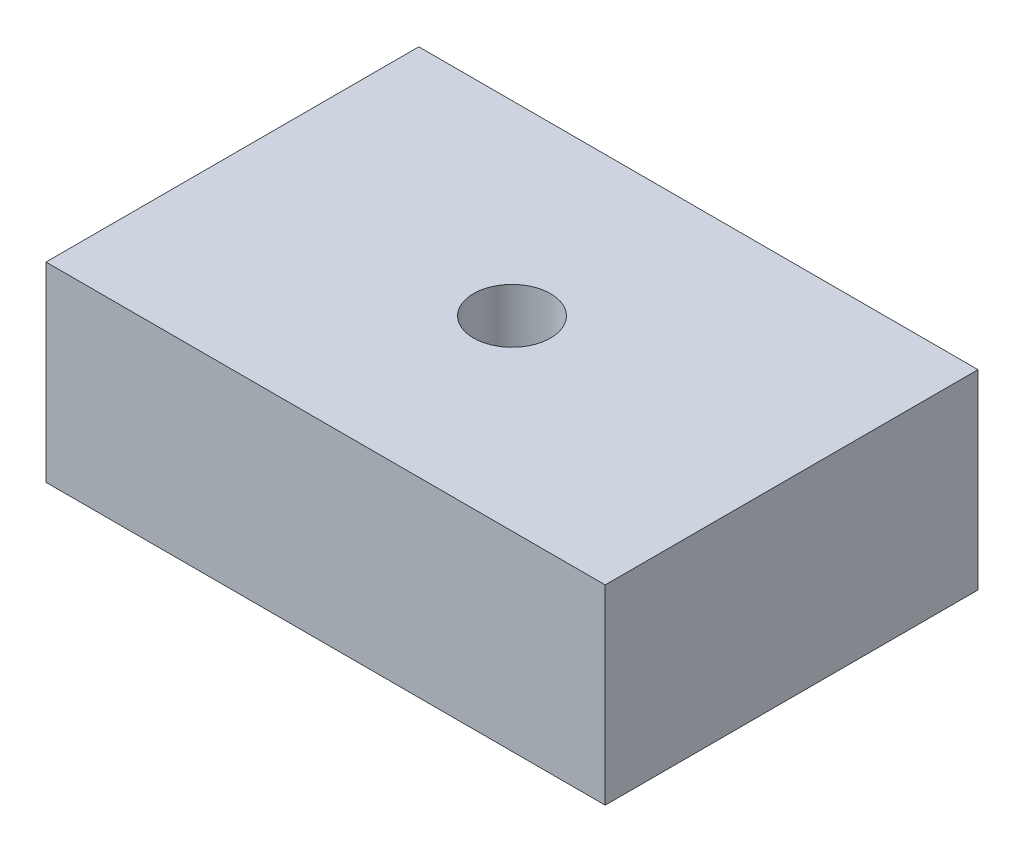
ISO-10303-21;
HEADER;
FILE_DESCRIPTION(('STEP AP214'),'2;1');
FILE_NAME('part.step','',(''),(''),'','','');
FILE_SCHEMA(('AUTOMOTIVE_DESIGN { 1 0 10303 214 1 1 1 1 }'));
ENDSEC;
DATA;
#1=APPLICATION_CONTEXT('core data for automotive mechanical design processes');
#2=APPLICATION_PROTOCOL_DEFINITION('international standard','automotive_design',2000,#1);
#3=PRODUCT_CONTEXT('',#1,'mechanical');
#4=PRODUCT('Part','Part','',(#3));
#5=PRODUCT_RELATED_PRODUCT_CATEGORY('part','',(#4));
#6=PRODUCT_DEFINITION_FORMATION('','',#4);
#7=PRODUCT_DEFINITION_CONTEXT('part definition',#1,'design');
#8=PRODUCT_DEFINITION('design','',#6,#7);
#9=PRODUCT_DEFINITION_SHAPE('','',#8);
#10=(LENGTH_UNIT() NAMED_UNIT(*) SI_UNIT(.MILLI.,.METRE.));
#11=(NAMED_UNIT(*) PLANE_ANGLE_UNIT() SI_UNIT($,.RADIAN.));
#12=(NAMED_UNIT(*) SI_UNIT($,.STERADIAN.) SOLID_ANGLE_UNIT());
#13=UNCERTAINTY_MEASURE_WITH_UNIT(LENGTH_MEASURE(1.E-05),#10,'distance_accuracy_value','');
#14=(GEOMETRIC_REPRESENTATION_CONTEXT(3) GLOBAL_UNCERTAINTY_ASSIGNED_CONTEXT((#13)) GLOBAL_UNIT_ASSIGNED_CONTEXT((#10,
#11,#12)) REPRESENTATION_CONTEXT('',''));
#15=CARTESIAN_POINT('',(0.,0.,0.));
#16=DIRECTION('',(0.,0.,1.));
#17=DIRECTION('',(1.,0.,0.));
#18=AXIS2_PLACEMENT_3D('',#15,#16,#17);
#19=CARTESIAN_POINT('',(38.1,26.,25.4));
#20=DIRECTION('',(0.,1.,0.));
#21=DIRECTION('',(0.,0.,1.));
#22=AXIS2_PLACEMENT_3D('',#19,#20,#21);
#23=PLANE('',#22);
#24=DIRECTION('',(0.,0.,-1.));
#25=VECTOR('',#24,1.);
#26=CARTESIAN_POINT('',(38.1,26.,-25.4));
#27=LINE('',#26,#25);
#28=CARTESIAN_POINT('',(38.1,26.,25.4));
#29=VERTEX_POINT('',#28);
#30=CARTESIAN_POINT('',(38.1,26.,-25.4));
#31=VERTEX_POINT('',#30);
#32=EDGE_CURVE('E85',#29,#31,#27,.T.);
#33=ORIENTED_EDGE('',*,*,#32,.T.);
#34=DIRECTION('',(-1.,0.,0.));
#35=VECTOR('',#34,1.);
#36=CARTESIAN_POINT('',(-38.1,26.,-25.4));
#37=LINE('',#36,#35);
#38=CARTESIAN_POINT('',(-38.1,26.,-25.4));
#39=VERTEX_POINT('',#38);
#40=EDGE_CURVE('E80',#31,#39,#37,.T.);
#41=ORIENTED_EDGE('',*,*,#40,.T.);
#42=DIRECTION('',(0.,0.,1.));
#43=VECTOR('',#42,1.);
#44=CARTESIAN_POINT('',(-38.1,26.,-25.4));
#45=LINE('',#44,#43);
#46=CARTESIAN_POINT('',(-38.1,26.,25.4));
#47=VERTEX_POINT('',#46);
#48=EDGE_CURVE('E83',#39,#47,#45,.T.);
#49=ORIENTED_EDGE('',*,*,#48,.T.);
#50=DIRECTION('',(1.,0.,0.));
#51=VECTOR('',#50,1.);
#52=CARTESIAN_POINT('',(-38.1,26.,25.4));
#53=LINE('',#52,#51);
#54=EDGE_CURVE('E50',#47,#29,#53,.T.);
#55=ORIENTED_EDGE('',*,*,#54,.T.);
#56=EDGE_LOOP('',(#33,#41,#49,#55));
#57=FACE_BOUND('',#56,.T.);
#58=CARTESIAN_POINT('',(0.,26.,0.));
#59=DIRECTION('',(0.,1.,0.));
#60=DIRECTION('',(0.,0.,1.));
#61=AXIS2_PLACEMENT_3D('',#58,#59,#60);
#62=CIRCLE('',#61,5.25);
#63=CARTESIAN_POINT('',(0.,26.,5.25));
#64=VERTEX_POINT('',#63);
#65=EDGE_CURVE('E100',#64,#64,#62,.T.);
#66=ORIENTED_EDGE('',*,*,#65,.F.);
#67=EDGE_LOOP('',(#66));
#68=FACE_BOUND('',#67,.T.);
#69=ADVANCED_FACE('F33',(#57,#68),#23,.T.);
#70=CARTESIAN_POINT('',(38.1,0.,25.4));
#71=DIRECTION('',(0.,1.,0.));
#72=DIRECTION('',(0.,0.,1.));
#73=AXIS2_PLACEMENT_3D('',#70,#71,#72);
#74=PLANE('',#73);
#75=DIRECTION('',(0.,0.,-1.));
#76=VECTOR('',#75,1.);
#77=CARTESIAN_POINT('',(38.1,0.,-25.4));
#78=LINE('',#77,#76);
#79=CARTESIAN_POINT('',(38.1,0.,25.4));
#80=VERTEX_POINT('',#79);
#81=CARTESIAN_POINT('',(38.1,0.,-25.4));
#82=VERTEX_POINT('',#81);
#83=EDGE_CURVE('E97',#80,#82,#78,.T.);
#84=ORIENTED_EDGE('',*,*,#83,.F.);
#85=DIRECTION('',(1.,0.,0.));
#86=VECTOR('',#85,1.);
#87=CARTESIAN_POINT('',(-38.1,0.,25.4));
#88=LINE('',#87,#86);
#89=CARTESIAN_POINT('',(-38.1,0.,25.4));
#90=VERTEX_POINT('',#89);
#91=EDGE_CURVE('E73',#90,#80,#88,.T.);
#92=ORIENTED_EDGE('',*,*,#91,.F.);
#93=DIRECTION('',(0.,0.,1.));
#94=VECTOR('',#93,1.);
#95=CARTESIAN_POINT('',(-38.1,0.,-25.4));
#96=LINE('',#95,#94);
#97=CARTESIAN_POINT('',(-38.1,0.,-25.4));
#98=VERTEX_POINT('',#97);
#99=EDGE_CURVE('E67',#98,#90,#96,.T.);
#100=ORIENTED_EDGE('',*,*,#99,.F.);
#101=DIRECTION('',(-1.,0.,0.));
#102=VECTOR('',#101,1.);
#103=CARTESIAN_POINT('',(-38.1,0.,-25.4));
#104=LINE('',#103,#102);
#105=EDGE_CURVE('E89',#82,#98,#104,.T.);
#106=ORIENTED_EDGE('',*,*,#105,.F.);
#107=EDGE_LOOP('',(#84,#92,#100,#106));
#108=FACE_BOUND('',#107,.T.);
#109=CARTESIAN_POINT('',(0.,0.,0.));
#110=DIRECTION('',(0.,1.,0.));
#111=DIRECTION('',(0.,0.,1.));
#112=AXIS2_PLACEMENT_3D('',#109,#110,#111);
#113=CIRCLE('',#112,5.25);
#114=CARTESIAN_POINT('',(0.,0.,5.25));
#115=VERTEX_POINT('',#114);
#116=EDGE_CURVE('E112',#115,#115,#113,.T.);
#117=ORIENTED_EDGE('',*,*,#116,.T.);
#118=EDGE_LOOP('',(#117));
#119=FACE_BOUND('',#118,.T.);
#120=ADVANCED_FACE('F108',(#108,#119),#74,.F.);
#121=CARTESIAN_POINT('',(38.1,26.,-25.4));
#122=DIRECTION('',(-1.,0.,0.));
#123=DIRECTION('',(0.,0.,1.));
#124=AXIS2_PLACEMENT_3D('',#121,#122,#123);
#125=PLANE('',#124);
#126=ORIENTED_EDGE('',*,*,#83,.T.);
#127=DIRECTION('',(0.,-1.,0.));
#128=VECTOR('',#127,1.);
#129=CARTESIAN_POINT('',(38.1,26.,-25.4));
#130=LINE('',#129,#128);
#131=EDGE_CURVE('E11',#31,#82,#130,.T.);
#132=ORIENTED_EDGE('',*,*,#131,.F.);
#133=ORIENTED_EDGE('',*,*,#32,.F.);
#134=DIRECTION('',(0.,-1.,0.));
#135=VECTOR('',#134,1.);
#136=CARTESIAN_POINT('',(38.1,26.,25.4));
#137=LINE('',#136,#135);
#138=EDGE_CURVE('E93',#29,#80,#137,.T.);
#139=ORIENTED_EDGE('',*,*,#138,.T.);
#140=EDGE_LOOP('',(#126,#132,#133,#139));
#141=FACE_BOUND('',#140,.T.);
#142=ADVANCED_FACE('F35',(#141),#125,.F.);
#143=CARTESIAN_POINT('',(-38.1,26.,-25.4));
#144=DIRECTION('',(0.,0.,1.));
#145=DIRECTION('',(1.,0.,0.));
#146=AXIS2_PLACEMENT_3D('',#143,#144,#145);
#147=PLANE('',#146);
#148=ORIENTED_EDGE('',*,*,#105,.T.);
#149=DIRECTION('',(0.,-1.,0.));
#150=VECTOR('',#149,1.);
#151=CARTESIAN_POINT('',(-38.1,26.,-25.4));
#152=LINE('',#151,#150);
#153=EDGE_CURVE('E42',#39,#98,#152,.T.);
#154=ORIENTED_EDGE('',*,*,#153,.F.);
#155=ORIENTED_EDGE('',*,*,#40,.F.);
#156=ORIENTED_EDGE('',*,*,#131,.T.);
#157=EDGE_LOOP('',(#148,#154,#155,#156));
#158=FACE_BOUND('',#157,.T.);
#159=ADVANCED_FACE('F88',(#158),#147,.F.);
#160=CARTESIAN_POINT('',(-38.1,26.,-25.4));
#161=DIRECTION('',(1.,0.,0.));
#162=DIRECTION('',(0.,0.,-1.));
#163=AXIS2_PLACEMENT_3D('',#160,#161,#162);
#164=PLANE('',#163);
#165=ORIENTED_EDGE('',*,*,#99,.T.);
#166=DIRECTION('',(0.,-1.,0.));
#167=VECTOR('',#166,1.);
#168=CARTESIAN_POINT('',(-38.1,26.,25.4));
#169=LINE('',#168,#167);
#170=EDGE_CURVE('E90',#47,#90,#169,.T.);
#171=ORIENTED_EDGE('',*,*,#170,.F.);
#172=ORIENTED_EDGE('',*,*,#48,.F.);
#173=ORIENTED_EDGE('',*,*,#153,.T.);
#174=EDGE_LOOP('',(#165,#171,#172,#173));
#175=FACE_BOUND('',#174,.T.);
#176=ADVANCED_FACE('F91',(#175),#164,.F.);
#177=CARTESIAN_POINT('',(-38.1,26.,25.4));
#178=DIRECTION('',(0.,0.,-1.));
#179=DIRECTION('',(-1.,0.,0.));
#180=AXIS2_PLACEMENT_3D('',#177,#178,#179);
#181=PLANE('',#180);
#182=ORIENTED_EDGE('',*,*,#91,.T.);
#183=ORIENTED_EDGE('',*,*,#138,.F.);
#184=ORIENTED_EDGE('',*,*,#54,.F.);
#185=ORIENTED_EDGE('',*,*,#170,.T.);
#186=EDGE_LOOP('',(#182,#183,#184,#185));
#187=FACE_BOUND('',#186,.T.);
#188=ADVANCED_FACE('F105',(#187),#181,.F.);
#189=CARTESIAN_POINT('',(0.,26.,0.));
#190=DIRECTION('',(0.,-1.,0.));
#191=DIRECTION('',(0.,0.,-1.));
#192=AXIS2_PLACEMENT_3D('',#189,#190,#191);
#193=CYLINDRICAL_SURFACE('',#192,5.25);
#194=ORIENTED_EDGE('',*,*,#65,.T.);
#195=EDGE_LOOP('',(#194));
#196=FACE_BOUND('',#195,.T.);
#197=ORIENTED_EDGE('',*,*,#116,.F.);
#198=EDGE_LOOP('',(#197));
#199=FACE_BOUND('',#198,.T.);
#200=ADVANCED_FACE('F118',(#196,#199),#193,.F.);
#201=CLOSED_SHELL('',(#69,#120,#142,#159,#176,#188,#200));
#202=MANIFOLD_SOLID_BREP('B2',#201);
#203=ADVANCED_BREP_SHAPE_REPRESENTATION('',(#18,#202),#14);
#204=SHAPE_DEFINITION_REPRESENTATION(#9,#203);
ENDSEC;
END-ISO-10303-21;
